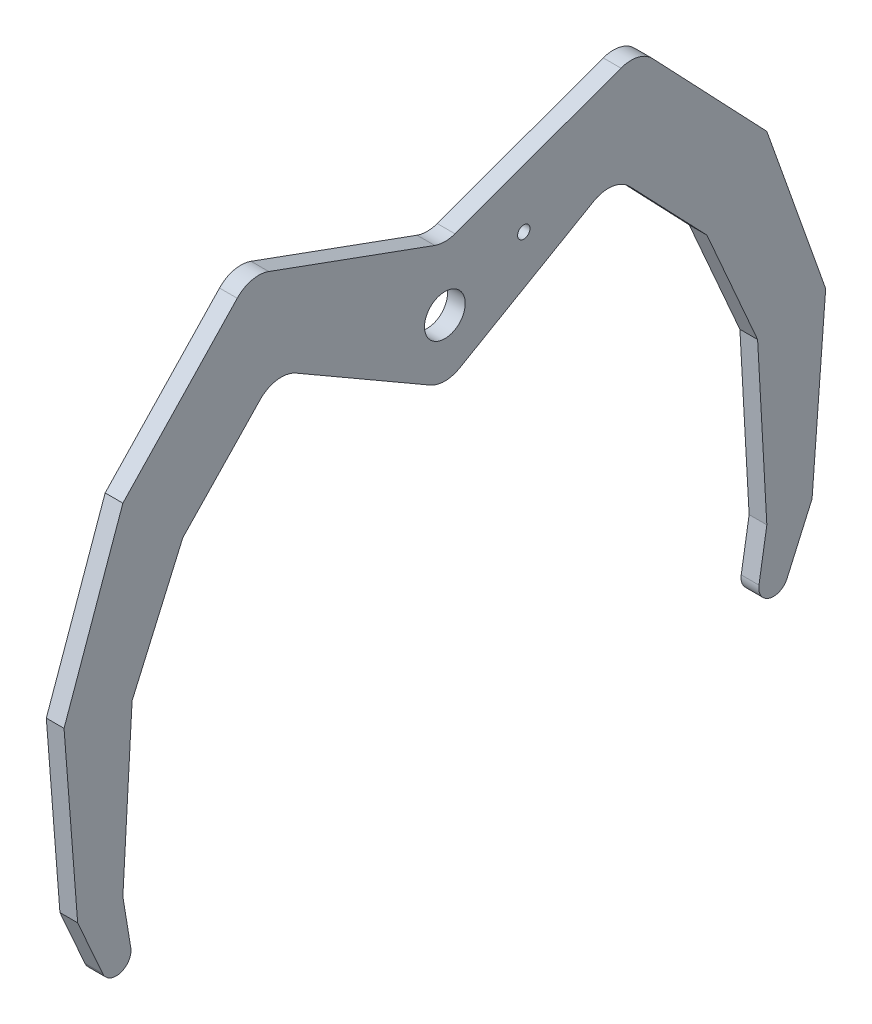
ISO-10303-21;
HEADER;
FILE_DESCRIPTION(('STEP AP214'),'2;1');
FILE_NAME('part.step','',(''),(''),'','','');
FILE_SCHEMA(('AUTOMOTIVE_DESIGN { 1 0 10303 214 1 1 1 1 }'));
ENDSEC;
DATA;
#1=APPLICATION_CONTEXT('core data for automotive mechanical design processes');
#2=APPLICATION_PROTOCOL_DEFINITION('international standard','automotive_design',2000,#1);
#3=PRODUCT_CONTEXT('',#1,'mechanical');
#4=PRODUCT('Part','Part','',(#3));
#5=PRODUCT_RELATED_PRODUCT_CATEGORY('part','',(#4));
#6=PRODUCT_DEFINITION_FORMATION('','',#4);
#7=PRODUCT_DEFINITION_CONTEXT('part definition',#1,'design');
#8=PRODUCT_DEFINITION('design','',#6,#7);
#9=PRODUCT_DEFINITION_SHAPE('','',#8);
#10=(LENGTH_UNIT() NAMED_UNIT(*) SI_UNIT(.MILLI.,.METRE.));
#11=(NAMED_UNIT(*) PLANE_ANGLE_UNIT() SI_UNIT($,.RADIAN.));
#12=(NAMED_UNIT(*) SI_UNIT($,.STERADIAN.) SOLID_ANGLE_UNIT());
#13=UNCERTAINTY_MEASURE_WITH_UNIT(LENGTH_MEASURE(1.E-05),#10,'distance_accuracy_value','');
#14=(GEOMETRIC_REPRESENTATION_CONTEXT(3) GLOBAL_UNCERTAINTY_ASSIGNED_CONTEXT((#13)) GLOBAL_UNIT_ASSIGNED_CONTEXT((#10,
#11,#12)) REPRESENTATION_CONTEXT('',''));
#15=CARTESIAN_POINT('',(0.,0.,0.));
#16=DIRECTION('',(0.,0.,1.));
#17=DIRECTION('',(1.,0.,0.));
#18=AXIS2_PLACEMENT_3D('',#15,#16,#17);
#19=CARTESIAN_POINT('',(3.,-66.5622399920911,-55.6324415796389));
#20=DIRECTION('',(1.,0.,0.));
#21=DIRECTION('',(0.,0.,-1.));
#22=AXIS2_PLACEMENT_3D('',#19,#20,#21);
#23=PLANE('',#22);
#24=CARTESIAN_POINT('',(3.,0.,0.));
#25=DIRECTION('',(1.,0.,0.));
#26=DIRECTION('',(0.,0.,-1.));
#27=AXIS2_PLACEMENT_3D('',#24,#25,#26);
#28=CIRCLE('',#27,3.45);
#29=CARTESIAN_POINT('',(3.,0.,-3.45));
#30=VERTEX_POINT('',#29);
#31=EDGE_CURVE('E254',#30,#30,#28,.T.);
#32=ORIENTED_EDGE('',*,*,#31,.F.);
#33=EDGE_LOOP('',(#32));
#34=FACE_BOUND('',#33,.T.);
#35=CARTESIAN_POINT('',(3.,-66.5622399920911,-55.6324415796389));
#36=DIRECTION('',(1.,0.,0.));
#37=DIRECTION('',(0.,0.,-1.));
#38=AXIS2_PLACEMENT_3D('',#35,#36,#37);
#39=CIRCLE('',#38,2.49999999999999);
#40=CARTESIAN_POINT('',(3.,-66.1574640748136,-53.1654279078502));
#41=VERTEX_POINT('',#40);
#42=CARTESIAN_POINT('',(3.,-67.5747741913046,-57.9182181425214));
#43=VERTEX_POINT('',#42);
#44=EDGE_CURVE('E305',#41,#43,#39,.T.);
#45=ORIENTED_EDGE('',*,*,#44,.T.);
#46=DIRECTION('',(0.,0.914310625153023,-0.405013679685377));
#47=VECTOR('',#46,1.);
#48=CARTESIAN_POINT('',(3.,-58.0020942634529,-62.1586438964939));
#49=LINE('',#48,#47);
#50=CARTESIAN_POINT('',(3.,-58.0020942634529,-62.1586438964939));
#51=VERTEX_POINT('',#50);
#52=EDGE_CURVE('E153',#43,#51,#49,.T.);
#53=ORIENTED_EDGE('',*,*,#52,.T.);
#54=DIRECTION('',(0.,0.996996693995207,-0.077444122841099));
#55=VECTOR('',#54,1.);
#56=CARTESIAN_POINT('',(3.,-58.0020942634529,-62.1586438964939));
#57=LINE('',#56,#55);
#58=CARTESIAN_POINT('',(3.,-28.3422759025482,-64.4625418235593));
#59=VERTEX_POINT('',#58);
#60=EDGE_CURVE('E380',#51,#59,#57,.T.);
#61=ORIENTED_EDGE('',*,*,#60,.T.);
#62=DIRECTION('',(0.,0.94230116363435,0.33476636183068));
#63=VECTOR('',#62,1.);
#64=CARTESIAN_POINT('',(3.,-28.3422759025482,-64.4625418235593));
#65=LINE('',#64,#63);
#66=CARTESIAN_POINT('',(3.,-0.309603855595102,-54.5035223553496));
#67=VERTEX_POINT('',#66);
#68=EDGE_CURVE('E399',#59,#67,#65,.T.);
#69=ORIENTED_EDGE('',*,*,#68,.T.);
#70=DIRECTION('',(0.,0.724673201543788,0.689092701285013));
#71=VECTOR('',#70,1.);
#72=CARTESIAN_POINT('',(3.,-0.309603855595102,-54.5035223553496));
#73=LINE('',#72,#71);
#74=CARTESIAN_POINT('',(3.,20.0477585303964,-35.1456796647183));
#75=VERTEX_POINT('',#74);
#76=EDGE_CURVE('E396',#67,#75,#73,.T.);
#77=ORIENTED_EDGE('',*,*,#76,.T.);
#78=CARTESIAN_POINT('',(3.,16.6022950239714,-31.5223136569994));
#79=DIRECTION('',(1.,0.,0.));
#80=DIRECTION('',(0.,0.,1.));
#81=AXIS2_PLACEMENT_3D('',#78,#79,#80);
#82=CIRCLE('',#81,5.);
#83=CARTESIAN_POINT('',(3.,21.3007581279009,-29.812212940371));
#84=VERTEX_POINT('',#83);
#85=EDGE_CURVE('E398',#75,#84,#82,.T.);
#86=ORIENTED_EDGE('',*,*,#85,.T.);
#87=DIRECTION('',(0.,-0.342020143325673,0.939692620785907));
#88=VECTOR('',#87,1.);
#89=CARTESIAN_POINT('',(3.,11.07242575845,-1.71010071662838));
#90=LINE('',#89,#88);
#91=CARTESIAN_POINT('',(3.,11.07242575845,-1.71010071662839));
#92=VERTEX_POINT('',#91);
#93=EDGE_CURVE('E401',#84,#92,#90,.T.);
#94=ORIENTED_EDGE('',*,*,#93,.T.);
#95=CARTESIAN_POINT('',(3.,15.7708888623796,0.));
#96=DIRECTION('',(-1.,0.,0.));
#97=DIRECTION('',(0.,0.,1.));
#98=AXIS2_PLACEMENT_3D('',#95,#96,#97);
#99=CIRCLE('',#98,5.);
#100=CARTESIAN_POINT('',(3.,11.07242575845,1.71010071662838));
#101=VERTEX_POINT('',#100);
#102=EDGE_CURVE('E407',#92,#101,#99,.T.);
#103=ORIENTED_EDGE('',*,*,#102,.T.);
#104=DIRECTION('',(0.,0.342020143325673,0.939692620785907));
#105=VECTOR('',#104,1.);
#106=CARTESIAN_POINT('',(3.,11.07242575845,1.71010071662838));
#107=LINE('',#106,#105);
#108=CARTESIAN_POINT('',(3.,21.3007581279009,29.812212940371));
#109=VERTEX_POINT('',#108);
#110=EDGE_CURVE('E409',#101,#109,#107,.T.);
#111=ORIENTED_EDGE('',*,*,#110,.T.);
#112=CARTESIAN_POINT('',(3.,16.6022950239714,31.5223136569994));
#113=DIRECTION('',(1.,0.,0.));
#114=DIRECTION('',(0.,0.,-1.));
#115=AXIS2_PLACEMENT_3D('',#112,#113,#114);
#116=CIRCLE('',#115,5.);
#117=CARTESIAN_POINT('',(3.,20.0477585303964,35.1456796647183));
#118=VERTEX_POINT('',#117);
#119=EDGE_CURVE('E411',#109,#118,#116,.T.);
#120=ORIENTED_EDGE('',*,*,#119,.T.);
#121=DIRECTION('',(0.,-0.724673201543788,0.689092701285013));
#122=VECTOR('',#121,1.);
#123=CARTESIAN_POINT('',(3.,-0.309603855595116,54.5035223553496));
#124=LINE('',#123,#122);
#125=CARTESIAN_POINT('',(3.,-0.309603855595116,54.5035223553496));
#126=VERTEX_POINT('',#125);
#127=EDGE_CURVE('E413',#118,#126,#124,.T.);
#128=ORIENTED_EDGE('',*,*,#127,.T.);
#129=DIRECTION('',(0.,-0.94230116363435,0.33476636183068));
#130=VECTOR('',#129,1.);
#131=CARTESIAN_POINT('',(3.,-28.3422759025482,64.4625418235593));
#132=LINE('',#131,#130);
#133=CARTESIAN_POINT('',(3.,-28.3422759025482,64.4625418235593));
#134=VERTEX_POINT('',#133);
#135=EDGE_CURVE('E415',#126,#134,#132,.T.);
#136=ORIENTED_EDGE('',*,*,#135,.T.);
#137=DIRECTION('',(0.,-0.996996693995207,-0.0774441228410994));
#138=VECTOR('',#137,1.);
#139=CARTESIAN_POINT('',(3.,-58.0020942634529,62.1586438964939));
#140=LINE('',#139,#138);
#141=CARTESIAN_POINT('',(3.,-58.0020942634529,62.1586438964939));
#142=VERTEX_POINT('',#141);
#143=EDGE_CURVE('E417',#134,#142,#140,.T.);
#144=ORIENTED_EDGE('',*,*,#143,.T.);
#145=DIRECTION('',(0.,-0.914310625153023,-0.405013679685375));
#146=VECTOR('',#145,1.);
#147=CARTESIAN_POINT('',(3.,-58.0020942634529,62.1586438964939));
#148=LINE('',#147,#146);
#149=CARTESIAN_POINT('',(3.,-67.5747741913046,57.9182181425214));
#150=VERTEX_POINT('',#149);
#151=EDGE_CURVE('E419',#142,#150,#148,.T.);
#152=ORIENTED_EDGE('',*,*,#151,.T.);
#153=CARTESIAN_POINT('',(3.,-66.5622399920911,55.6324415796389));
#154=DIRECTION('',(1.,0.,0.));
#155=DIRECTION('',(0.,0.,1.));
#156=AXIS2_PLACEMENT_3D('',#153,#154,#155);
#157=CIRCLE('',#156,2.50000000000001);
#158=CARTESIAN_POINT('',(3.,-66.1574640748136,53.1654279078502));
#159=VERTEX_POINT('',#158);
#160=EDGE_CURVE('E421',#150,#159,#157,.T.);
#161=ORIENTED_EDGE('',*,*,#160,.T.);
#162=DIRECTION('',(0.,0.986805468715459,0.161910366911026));
#163=VECTOR('',#162,1.);
#164=CARTESIAN_POINT('',(3.,-58.0020942634518,54.5035223553521));
#165=LINE('',#164,#163);
#166=CARTESIAN_POINT('',(3.,-58.0020942634518,54.5035223553521));
#167=VERTEX_POINT('',#166);
#168=EDGE_CURVE('E423',#159,#167,#165,.T.);
#169=ORIENTED_EDGE('',*,*,#168,.T.);
#170=DIRECTION('',(0.,0.998439677434941,-0.0558409394943517));
#171=VECTOR('',#170,1.);
#172=CARTESIAN_POINT('',(3.,-30.0455467703549,52.939962821096));
#173=LINE('',#172,#171);
#174=CARTESIAN_POINT('',(3.,-30.0455467703549,52.939962821096));
#175=VERTEX_POINT('',#174);
#176=EDGE_CURVE('E425',#167,#175,#173,.T.);
#177=ORIENTED_EDGE('',*,*,#176,.T.);
#178=DIRECTION('',(0.,0.916052504912047,-0.401058360147702));
#179=VECTOR('',#178,1.);
#180=CARTESIAN_POINT('',(3.,-10.4499999999942,44.3608062642641));
#181=LINE('',#180,#179);
#182=CARTESIAN_POINT('',(3.,-10.4499999999942,44.3608062642641));
#183=VERTEX_POINT('',#182);
#184=EDGE_CURVE('E427',#175,#183,#181,.T.);
#185=ORIENTED_EDGE('',*,*,#184,.T.);
#186=DIRECTION('',(0.,0.722655874852958,-0.691207990796191));
#187=VECTOR('',#186,1.);
#188=CARTESIAN_POINT('',(3.,-10.4499999999942,44.3608062642641));
#189=LINE('',#188,#187);
#190=CARTESIAN_POINT('',(3.,3.21304744696194,31.292334945346));
#191=VERTEX_POINT('',#190);
#192=EDGE_CURVE('E429',#183,#191,#189,.T.);
#193=ORIENTED_EDGE('',*,*,#192,.T.);
#194=CARTESIAN_POINT('',(3.,-0.242992507018251,27.6790555710804));
#195=DIRECTION('',(-1.,0.,0.));
#196=DIRECTION('',(0.,0.,1.));
#197=AXIS2_PLACEMENT_3D('',#194,#195,#196);
#198=CIRCLE('',#197,5.00000000000006);
#199=CARTESIAN_POINT('',(3.,4.08713451190401,25.1790555710804));
#200=VERTEX_POINT('',#199);
#201=EDGE_CURVE('E431',#191,#200,#198,.T.);
#202=ORIENTED_EDGE('',*,*,#201,.T.);
#203=DIRECTION('',(0.,-0.500000000000005,-0.866025403784436));
#204=VECTOR('',#203,1.);
#205=CARTESIAN_POINT('',(3.,-9.00662432702592,2.50000000000004));
#206=LINE('',#205,#204);
#207=CARTESIAN_POINT('',(3.,-9.00662432702591,2.50000000000004));
#208=VERTEX_POINT('',#207);
#209=EDGE_CURVE('E433',#200,#208,#206,.T.);
#210=ORIENTED_EDGE('',*,*,#209,.T.);
#211=CARTESIAN_POINT('',(3.,-4.67649730810375,0.));
#212=DIRECTION('',(1.,0.,0.));
#213=DIRECTION('',(0.,0.,-1.));
#214=AXIS2_PLACEMENT_3D('',#211,#212,#213);
#215=CIRCLE('',#214,5.);
#216=CARTESIAN_POINT('',(3.,-9.00662432702592,-2.50000000000005));
#217=VERTEX_POINT('',#216);
#218=EDGE_CURVE('E435',#208,#217,#215,.T.);
#219=ORIENTED_EDGE('',*,*,#218,.T.);
#220=DIRECTION('',(0.,0.500000000000004,-0.866025403784436));
#221=VECTOR('',#220,1.);
#222=CARTESIAN_POINT('',(3.,-9.00662432702592,-2.50000000000005));
#223=LINE('',#222,#221);
#224=CARTESIAN_POINT('',(3.,4.08713451190474,-25.1790555710809));
#225=VERTEX_POINT('',#224);
#226=EDGE_CURVE('E437',#217,#225,#223,.T.);
#227=ORIENTED_EDGE('',*,*,#226,.T.);
#228=CARTESIAN_POINT('',(3.,-0.242992507018233,-27.6790555710804));
#229=DIRECTION('',(-1.,0.,0.));
#230=DIRECTION('',(0.,0.,-1.));
#231=AXIS2_PLACEMENT_3D('',#228,#229,#230);
#232=CIRCLE('',#231,5.00000000000041);
#233=CARTESIAN_POINT('',(3.,3.21304744696305,-31.292334945346));
#234=VERTEX_POINT('',#233);
#235=EDGE_CURVE('E439',#225,#234,#232,.T.);
#236=ORIENTED_EDGE('',*,*,#235,.T.);
#237=DIRECTION('',(0.,-0.722655874852977,-0.691207990796171));
#238=VECTOR('',#237,1.);
#239=CARTESIAN_POINT('',(3.,-10.449999999994,-44.3608062642643));
#240=LINE('',#239,#238);
#241=CARTESIAN_POINT('',(3.,-10.449999999994,-44.3608062642643));
#242=VERTEX_POINT('',#241);
#243=EDGE_CURVE('E232',#234,#242,#240,.T.);
#244=ORIENTED_EDGE('',*,*,#243,.T.);
#245=DIRECTION('',(0.,-0.916052504912035,-0.40105836014773));
#246=VECTOR('',#245,1.);
#247=CARTESIAN_POINT('',(3.,-10.449999999994,-44.3608062642643));
#248=LINE('',#247,#246);
#249=CARTESIAN_POINT('',(3.,-30.0455467703544,-52.9399628210968));
#250=VERTEX_POINT('',#249);
#251=EDGE_CURVE('E226',#242,#250,#248,.T.);
#252=ORIENTED_EDGE('',*,*,#251,.T.);
#253=DIRECTION('',(0.,-0.998439677434942,-0.0558409394943253));
#254=VECTOR('',#253,1.);
#255=CARTESIAN_POINT('',(3.,-30.0455467703544,-52.9399628210968));
#256=LINE('',#255,#254);
#257=CARTESIAN_POINT('',(3.,-58.0020942634518,-54.5035223553522));
#258=VERTEX_POINT('',#257);
#259=EDGE_CURVE('E230',#250,#258,#256,.T.);
#260=ORIENTED_EDGE('',*,*,#259,.T.);
#261=DIRECTION('',(0.,-0.986805468715459,0.161910366911027));
#262=VECTOR('',#261,1.);
#263=CARTESIAN_POINT('',(3.,-58.0020942634518,-54.5035223553522));
#264=LINE('',#263,#262);
#265=EDGE_CURVE('E50',#258,#41,#264,.T.);
#266=ORIENTED_EDGE('',*,*,#265,.T.);
#267=EDGE_LOOP('',(#45,#53,#61,#69,#77,#86,#94,#103,#111,#120,#128,#136,#144,#152,#161,#169,
#177,#185,#193,#202,#210,#219,#227,#236,#244,#252,#260,#266));
#268=FACE_BOUND('',#267,.T.);
#269=CARTESIAN_POINT('',(3.,5.51119594978968,-13.3577400484896));
#270=DIRECTION('',(1.,0.,0.));
#271=DIRECTION('',(0.,0.,-1.));
#272=AXIS2_PLACEMENT_3D('',#269,#270,#271);
#273=CIRCLE('',#272,1.05);
#274=CARTESIAN_POINT('',(3.,5.51119594978968,-14.4077400484896));
#275=VERTEX_POINT('',#274);
#276=EDGE_CURVE('E481',#275,#275,#273,.T.);
#277=ORIENTED_EDGE('',*,*,#276,.F.);
#278=EDGE_LOOP('',(#277));
#279=FACE_BOUND('',#278,.T.);
#280=ADVANCED_FACE('F33',(#34,#268,#279),#23,.T.);
#281=CARTESIAN_POINT('',(0.,-66.5622399920911,-55.6324415796389));
#282=DIRECTION('',(1.,0.,0.));
#283=DIRECTION('',(0.,0.,-1.));
#284=AXIS2_PLACEMENT_3D('',#281,#282,#283);
#285=PLANE('',#284);
#286=CARTESIAN_POINT('',(0.,-66.5622399920911,-55.6324415796389));
#287=DIRECTION('',(1.,0.,0.));
#288=DIRECTION('',(0.,0.,-1.));
#289=AXIS2_PLACEMENT_3D('',#286,#287,#288);
#290=CIRCLE('',#289,2.49999999999999);
#291=CARTESIAN_POINT('',(0.,-66.1574640748136,-53.1654279078502));
#292=VERTEX_POINT('',#291);
#293=CARTESIAN_POINT('',(0.,-67.5747741913046,-57.9182181425214));
#294=VERTEX_POINT('',#293);
#295=EDGE_CURVE('E250',#292,#294,#290,.T.);
#296=ORIENTED_EDGE('',*,*,#295,.F.);
#297=DIRECTION('',(0.,-0.986805468715459,0.161910366911027));
#298=VECTOR('',#297,1.);
#299=CARTESIAN_POINT('',(0.,-58.0020942634518,-54.5035223553522));
#300=LINE('',#299,#298);
#301=CARTESIAN_POINT('',(0.,-58.0020942634518,-54.5035223553522));
#302=VERTEX_POINT('',#301);
#303=EDGE_CURVE('E145',#302,#292,#300,.T.);
#304=ORIENTED_EDGE('',*,*,#303,.F.);
#305=DIRECTION('',(0.,-0.998439677434942,-0.0558409394943253));
#306=VECTOR('',#305,1.);
#307=CARTESIAN_POINT('',(0.,-30.0455467703544,-52.9399628210968));
#308=LINE('',#307,#306);
#309=CARTESIAN_POINT('',(0.,-30.0455467703544,-52.9399628210968));
#310=VERTEX_POINT('',#309);
#311=EDGE_CURVE('E139',#310,#302,#308,.T.);
#312=ORIENTED_EDGE('',*,*,#311,.F.);
#313=DIRECTION('',(0.,-0.916052504912035,-0.40105836014773));
#314=VECTOR('',#313,1.);
#315=CARTESIAN_POINT('',(0.,-10.449999999994,-44.3608062642643));
#316=LINE('',#315,#314);
#317=CARTESIAN_POINT('',(0.,-10.449999999994,-44.3608062642643));
#318=VERTEX_POINT('',#317);
#319=EDGE_CURVE('E240',#318,#310,#316,.T.);
#320=ORIENTED_EDGE('',*,*,#319,.F.);
#321=DIRECTION('',(0.,-0.722655874852977,-0.691207990796171));
#322=VECTOR('',#321,1.);
#323=CARTESIAN_POINT('',(0.,-10.449999999994,-44.3608062642643));
#324=LINE('',#323,#322);
#325=CARTESIAN_POINT('',(0.,3.21304744696305,-31.292334945346));
#326=VERTEX_POINT('',#325);
#327=EDGE_CURVE('E300',#326,#318,#324,.T.);
#328=ORIENTED_EDGE('',*,*,#327,.F.);
#329=CARTESIAN_POINT('',(0.,-0.242992507018233,-27.6790555710804));
#330=DIRECTION('',(-1.,0.,0.));
#331=DIRECTION('',(0.,0.,-1.));
#332=AXIS2_PLACEMENT_3D('',#329,#330,#331);
#333=CIRCLE('',#332,5.00000000000041);
#334=CARTESIAN_POINT('',(0.,4.08713451190474,-25.1790555710809));
#335=VERTEX_POINT('',#334);
#336=EDGE_CURVE('E298',#335,#326,#333,.T.);
#337=ORIENTED_EDGE('',*,*,#336,.F.);
#338=DIRECTION('',(0.,0.500000000000004,-0.866025403784436));
#339=VECTOR('',#338,1.);
#340=CARTESIAN_POINT('',(0.,-9.00662432702592,-2.50000000000005));
#341=LINE('',#340,#339);
#342=CARTESIAN_POINT('',(0.,-9.00662432702592,-2.50000000000005));
#343=VERTEX_POINT('',#342);
#344=EDGE_CURVE('E296',#343,#335,#341,.T.);
#345=ORIENTED_EDGE('',*,*,#344,.F.);
#346=CARTESIAN_POINT('',(0.,-4.67649730810375,0.));
#347=DIRECTION('',(1.,0.,0.));
#348=DIRECTION('',(0.,0.,-1.));
#349=AXIS2_PLACEMENT_3D('',#346,#347,#348);
#350=CIRCLE('',#349,5.);
#351=CARTESIAN_POINT('',(0.,-9.00662432702591,2.50000000000004));
#352=VERTEX_POINT('',#351);
#353=EDGE_CURVE('E294',#352,#343,#350,.T.);
#354=ORIENTED_EDGE('',*,*,#353,.F.);
#355=DIRECTION('',(0.,-0.500000000000005,-0.866025403784436));
#356=VECTOR('',#355,1.);
#357=CARTESIAN_POINT('',(0.,-9.00662432702592,2.50000000000004));
#358=LINE('',#357,#356);
#359=CARTESIAN_POINT('',(0.,4.08713451190401,25.1790555710804));
#360=VERTEX_POINT('',#359);
#361=EDGE_CURVE('E292',#360,#352,#358,.T.);
#362=ORIENTED_EDGE('',*,*,#361,.F.);
#363=CARTESIAN_POINT('',(0.,-0.242992507018251,27.6790555710804));
#364=DIRECTION('',(-1.,0.,0.));
#365=DIRECTION('',(0.,0.,1.));
#366=AXIS2_PLACEMENT_3D('',#363,#364,#365);
#367=CIRCLE('',#366,5.00000000000006);
#368=CARTESIAN_POINT('',(0.,3.21304744696194,31.292334945346));
#369=VERTEX_POINT('',#368);
#370=EDGE_CURVE('E290',#369,#360,#367,.T.);
#371=ORIENTED_EDGE('',*,*,#370,.F.);
#372=DIRECTION('',(0.,0.722655874852958,-0.691207990796191));
#373=VECTOR('',#372,1.);
#374=CARTESIAN_POINT('',(0.,-10.4499999999942,44.3608062642641));
#375=LINE('',#374,#373);
#376=CARTESIAN_POINT('',(0.,-10.4499999999942,44.3608062642641));
#377=VERTEX_POINT('',#376);
#378=EDGE_CURVE('E288',#377,#369,#375,.T.);
#379=ORIENTED_EDGE('',*,*,#378,.F.);
#380=DIRECTION('',(0.,0.916052504912047,-0.401058360147702));
#381=VECTOR('',#380,1.);
#382=CARTESIAN_POINT('',(0.,-10.4499999999942,44.3608062642641));
#383=LINE('',#382,#381);
#384=CARTESIAN_POINT('',(0.,-30.0455467703549,52.939962821096));
#385=VERTEX_POINT('',#384);
#386=EDGE_CURVE('E286',#385,#377,#383,.T.);
#387=ORIENTED_EDGE('',*,*,#386,.F.);
#388=DIRECTION('',(0.,0.998439677434941,-0.0558409394943517));
#389=VECTOR('',#388,1.);
#390=CARTESIAN_POINT('',(0.,-30.0455467703549,52.939962821096));
#391=LINE('',#390,#389);
#392=CARTESIAN_POINT('',(0.,-58.0020942634518,54.5035223553521));
#393=VERTEX_POINT('',#392);
#394=EDGE_CURVE('E284',#393,#385,#391,.T.);
#395=ORIENTED_EDGE('',*,*,#394,.F.);
#396=DIRECTION('',(0.,0.986805468715459,0.161910366911026));
#397=VECTOR('',#396,1.);
#398=CARTESIAN_POINT('',(0.,-58.0020942634518,54.5035223553521));
#399=LINE('',#398,#397);
#400=CARTESIAN_POINT('',(0.,-66.1574640748136,53.1654279078502));
#401=VERTEX_POINT('',#400);
#402=EDGE_CURVE('E282',#401,#393,#399,.T.);
#403=ORIENTED_EDGE('',*,*,#402,.F.);
#404=CARTESIAN_POINT('',(0.,-66.5622399920911,55.6324415796389));
#405=DIRECTION('',(1.,0.,0.));
#406=DIRECTION('',(0.,0.,1.));
#407=AXIS2_PLACEMENT_3D('',#404,#405,#406);
#408=CIRCLE('',#407,2.50000000000001);
#409=CARTESIAN_POINT('',(0.,-67.5747741913046,57.9182181425214));
#410=VERTEX_POINT('',#409);
#411=EDGE_CURVE('E280',#410,#401,#408,.T.);
#412=ORIENTED_EDGE('',*,*,#411,.F.);
#413=DIRECTION('',(0.,-0.914310625153023,-0.405013679685375));
#414=VECTOR('',#413,1.);
#415=CARTESIAN_POINT('',(0.,-58.0020942634529,62.1586438964939));
#416=LINE('',#415,#414);
#417=CARTESIAN_POINT('',(0.,-58.0020942634529,62.1586438964939));
#418=VERTEX_POINT('',#417);
#419=EDGE_CURVE('E278',#418,#410,#416,.T.);
#420=ORIENTED_EDGE('',*,*,#419,.F.);
#421=DIRECTION('',(0.,-0.996996693995207,-0.0774441228410994));
#422=VECTOR('',#421,1.);
#423=CARTESIAN_POINT('',(0.,-58.0020942634529,62.1586438964939));
#424=LINE('',#423,#422);
#425=CARTESIAN_POINT('',(0.,-28.3422759025482,64.4625418235593));
#426=VERTEX_POINT('',#425);
#427=EDGE_CURVE('E276',#426,#418,#424,.T.);
#428=ORIENTED_EDGE('',*,*,#427,.F.);
#429=DIRECTION('',(0.,-0.94230116363435,0.33476636183068));
#430=VECTOR('',#429,1.);
#431=CARTESIAN_POINT('',(0.,-28.3422759025482,64.4625418235593));
#432=LINE('',#431,#430);
#433=CARTESIAN_POINT('',(0.,-0.309603855595116,54.5035223553496));
#434=VERTEX_POINT('',#433);
#435=EDGE_CURVE('E274',#434,#426,#432,.T.);
#436=ORIENTED_EDGE('',*,*,#435,.F.);
#437=DIRECTION('',(0.,-0.724673201543788,0.689092701285013));
#438=VECTOR('',#437,1.);
#439=CARTESIAN_POINT('',(0.,-0.309603855595116,54.5035223553496));
#440=LINE('',#439,#438);
#441=CARTESIAN_POINT('',(0.,20.0477585303964,35.1456796647183));
#442=VERTEX_POINT('',#441);
#443=EDGE_CURVE('E272',#442,#434,#440,.T.);
#444=ORIENTED_EDGE('',*,*,#443,.F.);
#445=CARTESIAN_POINT('',(0.,16.6022950239714,31.5223136569994));
#446=DIRECTION('',(1.,0.,0.));
#447=DIRECTION('',(0.,0.,-1.));
#448=AXIS2_PLACEMENT_3D('',#445,#446,#447);
#449=CIRCLE('',#448,5.);
#450=CARTESIAN_POINT('',(0.,21.3007581279009,29.812212940371));
#451=VERTEX_POINT('',#450);
#452=EDGE_CURVE('E270',#451,#442,#449,.T.);
#453=ORIENTED_EDGE('',*,*,#452,.F.);
#454=DIRECTION('',(0.,0.342020143325673,0.939692620785907));
#455=VECTOR('',#454,1.);
#456=CARTESIAN_POINT('',(0.,11.07242575845,1.71010071662838));
#457=LINE('',#456,#455);
#458=CARTESIAN_POINT('',(0.,11.07242575845,1.71010071662838));
#459=VERTEX_POINT('',#458);
#460=EDGE_CURVE('E268',#459,#451,#457,.T.);
#461=ORIENTED_EDGE('',*,*,#460,.F.);
#462=CARTESIAN_POINT('',(0.,15.7708888623796,0.));
#463=DIRECTION('',(-1.,0.,0.));
#464=DIRECTION('',(0.,0.,1.));
#465=AXIS2_PLACEMENT_3D('',#462,#463,#464);
#466=CIRCLE('',#465,5.);
#467=CARTESIAN_POINT('',(0.,11.07242575845,-1.71010071662839));
#468=VERTEX_POINT('',#467);
#469=EDGE_CURVE('E266',#468,#459,#466,.T.);
#470=ORIENTED_EDGE('',*,*,#469,.F.);
#471=DIRECTION('',(0.,-0.342020143325673,0.939692620785907));
#472=VECTOR('',#471,1.);
#473=CARTESIAN_POINT('',(0.,11.07242575845,-1.71010071662838));
#474=LINE('',#473,#472);
#475=CARTESIAN_POINT('',(0.,21.3007581279009,-29.812212940371));
#476=VERTEX_POINT('',#475);
#477=EDGE_CURVE('E264',#476,#468,#474,.T.);
#478=ORIENTED_EDGE('',*,*,#477,.F.);
#479=CARTESIAN_POINT('',(0.,16.6022950239714,-31.5223136569994));
#480=DIRECTION('',(1.,0.,0.));
#481=DIRECTION('',(0.,0.,1.));
#482=AXIS2_PLACEMENT_3D('',#479,#480,#481);
#483=CIRCLE('',#482,5.);
#484=CARTESIAN_POINT('',(0.,20.0477585303964,-35.1456796647183));
#485=VERTEX_POINT('',#484);
#486=EDGE_CURVE('E262',#485,#476,#483,.T.);
#487=ORIENTED_EDGE('',*,*,#486,.F.);
#488=DIRECTION('',(0.,0.724673201543788,0.689092701285013));
#489=VECTOR('',#488,1.);
#490=CARTESIAN_POINT('',(0.,-0.309603855595102,-54.5035223553496));
#491=LINE('',#490,#489);
#492=CARTESIAN_POINT('',(0.,-0.309603855595102,-54.5035223553496));
#493=VERTEX_POINT('',#492);
#494=EDGE_CURVE('E260',#493,#485,#491,.T.);
#495=ORIENTED_EDGE('',*,*,#494,.F.);
#496=DIRECTION('',(0.,0.94230116363435,0.33476636183068));
#497=VECTOR('',#496,1.);
#498=CARTESIAN_POINT('',(0.,-28.3422759025482,-64.4625418235593));
#499=LINE('',#498,#497);
#500=CARTESIAN_POINT('',(0.,-28.3422759025482,-64.4625418235593));
#501=VERTEX_POINT('',#500);
#502=EDGE_CURVE('E258',#501,#493,#499,.T.);
#503=ORIENTED_EDGE('',*,*,#502,.F.);
#504=DIRECTION('',(0.,0.996996693995207,-0.077444122841099));
#505=VECTOR('',#504,1.);
#506=CARTESIAN_POINT('',(0.,-58.0020942634529,-62.1586438964939));
#507=LINE('',#506,#505);
#508=CARTESIAN_POINT('',(0.,-58.0020942634529,-62.1586438964939));
#509=VERTEX_POINT('',#508);
#510=EDGE_CURVE('E256',#509,#501,#507,.T.);
#511=ORIENTED_EDGE('',*,*,#510,.F.);
#512=DIRECTION('',(0.,0.914310625153023,-0.405013679685377));
#513=VECTOR('',#512,1.);
#514=CARTESIAN_POINT('',(0.,-58.0020942634529,-62.1586438964939));
#515=LINE('',#514,#513);
#516=EDGE_CURVE('E253',#294,#509,#515,.T.);
#517=ORIENTED_EDGE('',*,*,#516,.F.);
#518=EDGE_LOOP('',(#296,#304,#312,#320,#328,#337,#345,#354,#362,#371,#379,#387,#395,#403,#412,
#420,#428,#436,#444,#453,#461,#470,#478,#487,#495,#503,#511,#517));
#519=FACE_BOUND('',#518,.T.);
#520=CARTESIAN_POINT('',(0.,0.,0.));
#521=DIRECTION('',(1.,0.,0.));
#522=DIRECTION('',(0.,0.,-1.));
#523=AXIS2_PLACEMENT_3D('',#520,#521,#522);
#524=CIRCLE('',#523,3.45);
#525=CARTESIAN_POINT('',(0.,0.,-3.45));
#526=VERTEX_POINT('',#525);
#527=EDGE_CURVE('E487',#526,#526,#524,.T.);
#528=ORIENTED_EDGE('',*,*,#527,.T.);
#529=EDGE_LOOP('',(#528));
#530=FACE_BOUND('',#529,.T.);
#531=CARTESIAN_POINT('',(0.,5.51119594978968,-13.3577400484896));
#532=DIRECTION('',(1.,0.,0.));
#533=DIRECTION('',(0.,0.,-1.));
#534=AXIS2_PLACEMENT_3D('',#531,#532,#533);
#535=CIRCLE('',#534,1.05);
#536=CARTESIAN_POINT('',(0.,5.51119594978968,-14.4077400484896));
#537=VERTEX_POINT('',#536);
#538=EDGE_CURVE('E484',#537,#537,#535,.T.);
#539=ORIENTED_EDGE('',*,*,#538,.T.);
#540=EDGE_LOOP('',(#539));
#541=FACE_BOUND('',#540,.T.);
#542=ADVANCED_FACE('F384',(#519,#530,#541),#285,.F.);
#543=CARTESIAN_POINT('',(3.,-66.5622399920911,-55.6324415796389));
#544=DIRECTION('',(-1.,0.,0.));
#545=DIRECTION('',(0.,0.,1.));
#546=AXIS2_PLACEMENT_3D('',#543,#544,#545);
#547=CYLINDRICAL_SURFACE('',#546,2.49999999999999);
#548=ORIENTED_EDGE('',*,*,#295,.T.);
#549=DIRECTION('',(-1.,0.,0.));
#550=VECTOR('',#549,1.);
#551=CARTESIAN_POINT('',(3.,-67.5747741913046,-57.9182181425214));
#552=LINE('',#551,#550);
#553=EDGE_CURVE('E11',#43,#294,#552,.T.);
#554=ORIENTED_EDGE('',*,*,#553,.F.);
#555=ORIENTED_EDGE('',*,*,#44,.F.);
#556=DIRECTION('',(-1.,0.,0.));
#557=VECTOR('',#556,1.);
#558=CARTESIAN_POINT('',(3.,-66.1574640748136,-53.1654279078502));
#559=LINE('',#558,#557);
#560=EDGE_CURVE('E246',#41,#292,#559,.T.);
#561=ORIENTED_EDGE('',*,*,#560,.T.);
#562=EDGE_LOOP('',(#548,#554,#555,#561));
#563=FACE_BOUND('',#562,.T.);
#564=ADVANCED_FACE('F35',(#563),#547,.T.);
#565=CARTESIAN_POINT('',(3.,-58.0020942634529,-62.1586438964939));
#566=DIRECTION('',(0.,0.405013679685377,0.914310625153022));
#567=DIRECTION('',(0.,-0.914310625153023,0.405013679685377));
#568=AXIS2_PLACEMENT_3D('',#565,#566,#567);
#569=PLANE('',#568);
#570=ORIENTED_EDGE('',*,*,#516,.T.);
#571=DIRECTION('',(-1.,0.,0.));
#572=VECTOR('',#571,1.);
#573=CARTESIAN_POINT('',(3.,-58.0020942634529,-62.1586438964939));
#574=LINE('',#573,#572);
#575=EDGE_CURVE('E42',#51,#509,#574,.T.);
#576=ORIENTED_EDGE('',*,*,#575,.F.);
#577=ORIENTED_EDGE('',*,*,#52,.F.);
#578=ORIENTED_EDGE('',*,*,#553,.T.);
#579=EDGE_LOOP('',(#570,#576,#577,#578));
#580=FACE_BOUND('',#579,.T.);
#581=ADVANCED_FACE('F740',(#580),#569,.F.);
#582=CARTESIAN_POINT('',(3.,-58.0020942634529,-62.1586438964939));
#583=DIRECTION('',(0.,0.077444122841099,0.996996693995207));
#584=DIRECTION('',(0.,-0.996996693995207,0.077444122841099));
#585=AXIS2_PLACEMENT_3D('',#582,#583,#584);
#586=PLANE('',#585);
#587=ORIENTED_EDGE('',*,*,#510,.T.);
#588=DIRECTION('',(-1.,0.,0.));
#589=VECTOR('',#588,1.);
#590=CARTESIAN_POINT('',(3.,-28.3422759025482,-64.4625418235593));
#591=LINE('',#590,#589);
#592=EDGE_CURVE('E372',#59,#501,#591,.T.);
#593=ORIENTED_EDGE('',*,*,#592,.F.);
#594=ORIENTED_EDGE('',*,*,#60,.F.);
#595=ORIENTED_EDGE('',*,*,#575,.T.);
#596=EDGE_LOOP('',(#587,#593,#594,#595));
#597=FACE_BOUND('',#596,.T.);
#598=ADVANCED_FACE('F378',(#597),#586,.F.);
#599=CARTESIAN_POINT('',(3.,-28.3422759025482,-64.4625418235593));
#600=DIRECTION('',(0.,-0.33476636183068,0.94230116363435));
#601=DIRECTION('',(0.,-0.94230116363435,-0.33476636183068));
#602=AXIS2_PLACEMENT_3D('',#599,#600,#601);
#603=PLANE('',#602);
#604=ORIENTED_EDGE('',*,*,#502,.T.);
#605=DIRECTION('',(-1.,0.,0.));
#606=VECTOR('',#605,1.);
#607=CARTESIAN_POINT('',(3.,-0.309603855595102,-54.5035223553496));
#608=LINE('',#607,#606);
#609=EDGE_CURVE('E369',#67,#493,#608,.T.);
#610=ORIENTED_EDGE('',*,*,#609,.F.);
#611=ORIENTED_EDGE('',*,*,#68,.F.);
#612=ORIENTED_EDGE('',*,*,#592,.T.);
#613=EDGE_LOOP('',(#604,#610,#611,#612));
#614=FACE_BOUND('',#613,.T.);
#615=ADVANCED_FACE('F390',(#614),#603,.F.);
#616=CARTESIAN_POINT('',(3.,-0.309603855595102,-54.5035223553496));
#617=DIRECTION('',(0.,-0.689092701285013,0.724673201543788));
#618=DIRECTION('',(0.,-0.724673201543788,-0.689092701285013));
#619=AXIS2_PLACEMENT_3D('',#616,#617,#618);
#620=PLANE('',#619);
#621=ORIENTED_EDGE('',*,*,#494,.T.);
#622=DIRECTION('',(-1.,0.,0.));
#623=VECTOR('',#622,1.);
#624=CARTESIAN_POINT('',(3.,20.0477585303964,-35.1456796647183));
#625=LINE('',#624,#623);
#626=EDGE_CURVE('E366',#75,#485,#625,.T.);
#627=ORIENTED_EDGE('',*,*,#626,.F.);
#628=ORIENTED_EDGE('',*,*,#76,.F.);
#629=ORIENTED_EDGE('',*,*,#609,.T.);
#630=EDGE_LOOP('',(#621,#627,#628,#629));
#631=FACE_BOUND('',#630,.T.);
#632=ADVANCED_FACE('F394',(#631),#620,.F.);
#633=CARTESIAN_POINT('',(3.,16.6022950239714,-31.5223136569994));
#634=DIRECTION('',(-1.,0.,0.));
#635=DIRECTION('',(0.,0.,1.));
#636=AXIS2_PLACEMENT_3D('',#633,#634,#635);
#637=CYLINDRICAL_SURFACE('',#636,5.);
#638=ORIENTED_EDGE('',*,*,#486,.T.);
#639=DIRECTION('',(-1.,0.,0.));
#640=VECTOR('',#639,1.);
#641=CARTESIAN_POINT('',(3.,21.3007581279009,-29.812212940371));
#642=LINE('',#641,#640);
#643=EDGE_CURVE('E363',#84,#476,#642,.T.);
#644=ORIENTED_EDGE('',*,*,#643,.F.);
#645=ORIENTED_EDGE('',*,*,#85,.F.);
#646=ORIENTED_EDGE('',*,*,#626,.T.);
#647=EDGE_LOOP('',(#638,#644,#645,#646));
#648=FACE_BOUND('',#647,.T.);
#649=ADVANCED_FACE('F705',(#648),#637,.T.);
#650=CARTESIAN_POINT('',(3.,11.07242575845,-1.71010071662838));
#651=DIRECTION('',(0.,-0.939692620785907,-0.342020143325673));
#652=DIRECTION('',(0.,0.342020143325673,-0.939692620785907));
#653=AXIS2_PLACEMENT_3D('',#650,#651,#652);
#654=PLANE('',#653);
#655=ORIENTED_EDGE('',*,*,#477,.T.);
#656=DIRECTION('',(-1.,0.,0.));
#657=VECTOR('',#656,1.);
#658=CARTESIAN_POINT('',(3.,11.07242575845,-1.71010071662839));
#659=LINE('',#658,#657);
#660=EDGE_CURVE('E360',#92,#468,#659,.T.);
#661=ORIENTED_EDGE('',*,*,#660,.F.);
#662=ORIENTED_EDGE('',*,*,#93,.F.);
#663=ORIENTED_EDGE('',*,*,#643,.T.);
#664=EDGE_LOOP('',(#655,#661,#662,#663));
#665=FACE_BOUND('',#664,.T.);
#666=ADVANCED_FACE('F695',(#665),#654,.F.);
#667=CARTESIAN_POINT('',(3.,15.7708888623796,0.));
#668=DIRECTION('',(-1.,0.,0.));
#669=DIRECTION('',(0.,0.,1.));
#670=AXIS2_PLACEMENT_3D('',#667,#668,#669);
#671=CYLINDRICAL_SURFACE('',#670,5.);
#672=ORIENTED_EDGE('',*,*,#469,.T.);
#673=DIRECTION('',(-1.,0.,0.));
#674=VECTOR('',#673,1.);
#675=CARTESIAN_POINT('',(3.,11.07242575845,1.71010071662838));
#676=LINE('',#675,#674);
#677=EDGE_CURVE('E357',#101,#459,#676,.T.);
#678=ORIENTED_EDGE('',*,*,#677,.F.);
#679=ORIENTED_EDGE('',*,*,#102,.F.);
#680=ORIENTED_EDGE('',*,*,#660,.T.);
#681=EDGE_LOOP('',(#672,#678,#679,#680));
#682=FACE_BOUND('',#681,.T.);
#683=ADVANCED_FACE('F685',(#682),#671,.F.);
#684=CARTESIAN_POINT('',(3.,11.07242575845,1.71010071662838));
#685=DIRECTION('',(0.,-0.939692620785907,0.342020143325673));
#686=DIRECTION('',(0.,-0.342020143325673,-0.939692620785907));
#687=AXIS2_PLACEMENT_3D('',#684,#685,#686);
#688=PLANE('',#687);
#689=ORIENTED_EDGE('',*,*,#460,.T.);
#690=DIRECTION('',(-1.,0.,0.));
#691=VECTOR('',#690,1.);
#692=CARTESIAN_POINT('',(3.,21.3007581279009,29.812212940371));
#693=LINE('',#692,#691);
#694=EDGE_CURVE('E354',#109,#451,#693,.T.);
#695=ORIENTED_EDGE('',*,*,#694,.F.);
#696=ORIENTED_EDGE('',*,*,#110,.F.);
#697=ORIENTED_EDGE('',*,*,#677,.T.);
#698=EDGE_LOOP('',(#689,#695,#696,#697));
#699=FACE_BOUND('',#698,.T.);
#700=ADVANCED_FACE('F675',(#699),#688,.F.);
#701=CARTESIAN_POINT('',(3.,16.6022950239714,31.5223136569994));
#702=DIRECTION('',(-1.,0.,0.));
#703=DIRECTION('',(0.,0.,1.));
#704=AXIS2_PLACEMENT_3D('',#701,#702,#703);
#705=CYLINDRICAL_SURFACE('',#704,5.);
#706=ORIENTED_EDGE('',*,*,#452,.T.);
#707=DIRECTION('',(-1.,0.,0.));
#708=VECTOR('',#707,1.);
#709=CARTESIAN_POINT('',(3.,20.0477585303964,35.1456796647183));
#710=LINE('',#709,#708);
#711=EDGE_CURVE('E351',#118,#442,#710,.T.);
#712=ORIENTED_EDGE('',*,*,#711,.F.);
#713=ORIENTED_EDGE('',*,*,#119,.F.);
#714=ORIENTED_EDGE('',*,*,#694,.T.);
#715=EDGE_LOOP('',(#706,#712,#713,#714));
#716=FACE_BOUND('',#715,.T.);
#717=ADVANCED_FACE('F665',(#716),#705,.T.);
#718=CARTESIAN_POINT('',(3.,-0.309603855595116,54.5035223553496));
#719=DIRECTION('',(0.,-0.689092701285013,-0.724673201543788));
#720=DIRECTION('',(0.,0.724673201543788,-0.689092701285013));
#721=AXIS2_PLACEMENT_3D('',#718,#719,#720);
#722=PLANE('',#721);
#723=ORIENTED_EDGE('',*,*,#443,.T.);
#724=DIRECTION('',(-1.,0.,0.));
#725=VECTOR('',#724,1.);
#726=CARTESIAN_POINT('',(3.,-0.309603855595116,54.5035223553496));
#727=LINE('',#726,#725);
#728=EDGE_CURVE('E348',#126,#434,#727,.T.);
#729=ORIENTED_EDGE('',*,*,#728,.F.);
#730=ORIENTED_EDGE('',*,*,#127,.F.);
#731=ORIENTED_EDGE('',*,*,#711,.T.);
#732=EDGE_LOOP('',(#723,#729,#730,#731));
#733=FACE_BOUND('',#732,.T.);
#734=ADVANCED_FACE('F655',(#733),#722,.F.);
#735=CARTESIAN_POINT('',(3.,-28.3422759025482,64.4625418235593));
#736=DIRECTION('',(0.,-0.33476636183068,-0.94230116363435));
#737=DIRECTION('',(0.,0.94230116363435,-0.33476636183068));
#738=AXIS2_PLACEMENT_3D('',#735,#736,#737);
#739=PLANE('',#738);
#740=ORIENTED_EDGE('',*,*,#435,.T.);
#741=DIRECTION('',(-1.,0.,0.));
#742=VECTOR('',#741,1.);
#743=CARTESIAN_POINT('',(3.,-28.3422759025482,64.4625418235593));
#744=LINE('',#743,#742);
#745=EDGE_CURVE('E345',#134,#426,#744,.T.);
#746=ORIENTED_EDGE('',*,*,#745,.F.);
#747=ORIENTED_EDGE('',*,*,#135,.F.);
#748=ORIENTED_EDGE('',*,*,#728,.T.);
#749=EDGE_LOOP('',(#740,#746,#747,#748));
#750=FACE_BOUND('',#749,.T.);
#751=ADVANCED_FACE('F645',(#750),#739,.F.);
#752=CARTESIAN_POINT('',(3.,-58.0020942634529,62.1586438964939));
#753=DIRECTION('',(0.,0.0774441228410994,-0.996996693995207));
#754=DIRECTION('',(0.,0.996996693995207,0.0774441228410994));
#755=AXIS2_PLACEMENT_3D('',#752,#753,#754);
#756=PLANE('',#755);
#757=ORIENTED_EDGE('',*,*,#427,.T.);
#758=DIRECTION('',(-1.,0.,0.));
#759=VECTOR('',#758,1.);
#760=CARTESIAN_POINT('',(3.,-58.0020942634529,62.1586438964939));
#761=LINE('',#760,#759);
#762=EDGE_CURVE('E342',#142,#418,#761,.T.);
#763=ORIENTED_EDGE('',*,*,#762,.F.);
#764=ORIENTED_EDGE('',*,*,#143,.F.);
#765=ORIENTED_EDGE('',*,*,#745,.T.);
#766=EDGE_LOOP('',(#757,#763,#764,#765));
#767=FACE_BOUND('',#766,.T.);
#768=ADVANCED_FACE('F635',(#767),#756,.F.);
#769=CARTESIAN_POINT('',(3.,-58.0020942634529,62.1586438964939));
#770=DIRECTION('',(0.,0.405013679685375,-0.914310625153023));
#771=DIRECTION('',(0.,0.914310625153023,0.405013679685376));
#772=AXIS2_PLACEMENT_3D('',#769,#770,#771);
#773=PLANE('',#772);
#774=ORIENTED_EDGE('',*,*,#419,.T.);
#775=DIRECTION('',(-1.,0.,0.));
#776=VECTOR('',#775,1.);
#777=CARTESIAN_POINT('',(3.,-67.5747741913046,57.9182181425214));
#778=LINE('',#777,#776);
#779=EDGE_CURVE('E339',#150,#410,#778,.T.);
#780=ORIENTED_EDGE('',*,*,#779,.F.);
#781=ORIENTED_EDGE('',*,*,#151,.F.);
#782=ORIENTED_EDGE('',*,*,#762,.T.);
#783=EDGE_LOOP('',(#774,#780,#781,#782));
#784=FACE_BOUND('',#783,.T.);
#785=ADVANCED_FACE('F625',(#784),#773,.F.);
#786=CARTESIAN_POINT('',(3.,-66.5622399920911,55.6324415796389));
#787=DIRECTION('',(-1.,0.,0.));
#788=DIRECTION('',(0.,0.,1.));
#789=AXIS2_PLACEMENT_3D('',#786,#787,#788);
#790=CYLINDRICAL_SURFACE('',#789,2.50000000000001);
#791=ORIENTED_EDGE('',*,*,#411,.T.);
#792=DIRECTION('',(-1.,0.,0.));
#793=VECTOR('',#792,1.);
#794=CARTESIAN_POINT('',(3.,-66.1574640748136,53.1654279078502));
#795=LINE('',#794,#793);
#796=EDGE_CURVE('E336',#159,#401,#795,.T.);
#797=ORIENTED_EDGE('',*,*,#796,.F.);
#798=ORIENTED_EDGE('',*,*,#160,.F.);
#799=ORIENTED_EDGE('',*,*,#779,.T.);
#800=EDGE_LOOP('',(#791,#797,#798,#799));
#801=FACE_BOUND('',#800,.T.);
#802=ADVANCED_FACE('F615',(#801),#790,.T.);
#803=CARTESIAN_POINT('',(3.,-58.0020942634518,54.5035223553521));
#804=DIRECTION('',(0.,-0.161910366911026,0.986805468715459));
#805=DIRECTION('',(0.,-0.986805468715459,-0.161910366911026));
#806=AXIS2_PLACEMENT_3D('',#803,#804,#805);
#807=PLANE('',#806);
#808=ORIENTED_EDGE('',*,*,#402,.T.);
#809=DIRECTION('',(-1.,0.,0.));
#810=VECTOR('',#809,1.);
#811=CARTESIAN_POINT('',(3.,-58.0020942634518,54.5035223553521));
#812=LINE('',#811,#810);
#813=EDGE_CURVE('E333',#167,#393,#812,.T.);
#814=ORIENTED_EDGE('',*,*,#813,.F.);
#815=ORIENTED_EDGE('',*,*,#168,.F.);
#816=ORIENTED_EDGE('',*,*,#796,.T.);
#817=EDGE_LOOP('',(#808,#814,#815,#816));
#818=FACE_BOUND('',#817,.T.);
#819=ADVANCED_FACE('F605',(#818),#807,.F.);
#820=CARTESIAN_POINT('',(3.,-30.0455467703549,52.939962821096));
#821=DIRECTION('',(0.,0.0558409394943517,0.998439677434941));
#822=DIRECTION('',(0.,-0.998439677434941,0.0558409394943517));
#823=AXIS2_PLACEMENT_3D('',#820,#821,#822);
#824=PLANE('',#823);
#825=ORIENTED_EDGE('',*,*,#394,.T.);
#826=DIRECTION('',(-1.,0.,0.));
#827=VECTOR('',#826,1.);
#828=CARTESIAN_POINT('',(3.,-30.0455467703549,52.939962821096));
#829=LINE('',#828,#827);
#830=EDGE_CURVE('E330',#175,#385,#829,.T.);
#831=ORIENTED_EDGE('',*,*,#830,.F.);
#832=ORIENTED_EDGE('',*,*,#176,.F.);
#833=ORIENTED_EDGE('',*,*,#813,.T.);
#834=EDGE_LOOP('',(#825,#831,#832,#833));
#835=FACE_BOUND('',#834,.T.);
#836=ADVANCED_FACE('F595',(#835),#824,.F.);
#837=CARTESIAN_POINT('',(3.,-10.4499999999942,44.3608062642641));
#838=DIRECTION('',(0.,0.401058360147701,0.916052504912047));
#839=DIRECTION('',(0.,-0.916052504912047,0.401058360147702));
#840=AXIS2_PLACEMENT_3D('',#837,#838,#839);
#841=PLANE('',#840);
#842=ORIENTED_EDGE('',*,*,#386,.T.);
#843=DIRECTION('',(-1.,0.,0.));
#844=VECTOR('',#843,1.);
#845=CARTESIAN_POINT('',(3.,-10.4499999999942,44.3608062642641));
#846=LINE('',#845,#844);
#847=EDGE_CURVE('E327',#183,#377,#846,.T.);
#848=ORIENTED_EDGE('',*,*,#847,.F.);
#849=ORIENTED_EDGE('',*,*,#184,.F.);
#850=ORIENTED_EDGE('',*,*,#830,.T.);
#851=EDGE_LOOP('',(#842,#848,#849,#850));
#852=FACE_BOUND('',#851,.T.);
#853=ADVANCED_FACE('F585',(#852),#841,.F.);
#854=CARTESIAN_POINT('',(3.,-10.4499999999942,44.3608062642641));
#855=DIRECTION('',(0.,0.69120799079619,0.722655874852957));
#856=DIRECTION('',(0.,-0.722655874852958,0.691207990796191));
#857=AXIS2_PLACEMENT_3D('',#854,#855,#856);
#858=PLANE('',#857);
#859=ORIENTED_EDGE('',*,*,#378,.T.);
#860=DIRECTION('',(-1.,0.,0.));
#861=VECTOR('',#860,1.);
#862=CARTESIAN_POINT('',(3.,3.21304744696194,31.292334945346));
#863=LINE('',#862,#861);
#864=EDGE_CURVE('E324',#191,#369,#863,.T.);
#865=ORIENTED_EDGE('',*,*,#864,.F.);
#866=ORIENTED_EDGE('',*,*,#192,.F.);
#867=ORIENTED_EDGE('',*,*,#847,.T.);
#868=EDGE_LOOP('',(#859,#865,#866,#867));
#869=FACE_BOUND('',#868,.T.);
#870=ADVANCED_FACE('F575',(#869),#858,.F.);
#871=CARTESIAN_POINT('',(3.,-0.242992507018251,27.6790555710804));
#872=DIRECTION('',(-1.,0.,0.));
#873=DIRECTION('',(0.,0.,1.));
#874=AXIS2_PLACEMENT_3D('',#871,#872,#873);
#875=CYLINDRICAL_SURFACE('',#874,5.00000000000006);
#876=ORIENTED_EDGE('',*,*,#370,.T.);
#877=DIRECTION('',(-1.,0.,0.));
#878=VECTOR('',#877,1.);
#879=CARTESIAN_POINT('',(3.,4.08713451190401,25.1790555710804));
#880=LINE('',#879,#878);
#881=EDGE_CURVE('E321',#200,#360,#880,.T.);
#882=ORIENTED_EDGE('',*,*,#881,.F.);
#883=ORIENTED_EDGE('',*,*,#201,.F.);
#884=ORIENTED_EDGE('',*,*,#864,.T.);
#885=EDGE_LOOP('',(#876,#882,#883,#884));
#886=FACE_BOUND('',#885,.T.);
#887=ADVANCED_FACE('F565',(#886),#875,.F.);
#888=CARTESIAN_POINT('',(3.,-9.00662432702592,2.50000000000004));
#889=DIRECTION('',(0.,0.866025403784435,-0.500000000000005));
#890=DIRECTION('',(0.,0.500000000000005,0.866025403784436));
#891=AXIS2_PLACEMENT_3D('',#888,#889,#890);
#892=PLANE('',#891);
#893=ORIENTED_EDGE('',*,*,#361,.T.);
#894=DIRECTION('',(-1.,0.,0.));
#895=VECTOR('',#894,1.);
#896=CARTESIAN_POINT('',(3.,-9.00662432702591,2.50000000000004));
#897=LINE('',#896,#895);
#898=EDGE_CURVE('E318',#208,#352,#897,.T.);
#899=ORIENTED_EDGE('',*,*,#898,.F.);
#900=ORIENTED_EDGE('',*,*,#209,.F.);
#901=ORIENTED_EDGE('',*,*,#881,.T.);
#902=EDGE_LOOP('',(#893,#899,#900,#901));
#903=FACE_BOUND('',#902,.T.);
#904=ADVANCED_FACE('F555',(#903),#892,.F.);
#905=CARTESIAN_POINT('',(3.,-4.67649730810375,0.));
#906=DIRECTION('',(-1.,0.,0.));
#907=DIRECTION('',(0.,0.,1.));
#908=AXIS2_PLACEMENT_3D('',#905,#906,#907);
#909=CYLINDRICAL_SURFACE('',#908,5.);
#910=ORIENTED_EDGE('',*,*,#353,.T.);
#911=DIRECTION('',(-1.,0.,0.));
#912=VECTOR('',#911,1.);
#913=CARTESIAN_POINT('',(3.,-9.00662432702592,-2.50000000000005));
#914=LINE('',#913,#912);
#915=EDGE_CURVE('E315',#217,#343,#914,.T.);
#916=ORIENTED_EDGE('',*,*,#915,.F.);
#917=ORIENTED_EDGE('',*,*,#218,.F.);
#918=ORIENTED_EDGE('',*,*,#898,.T.);
#919=EDGE_LOOP('',(#910,#916,#917,#918));
#920=FACE_BOUND('',#919,.T.);
#921=ADVANCED_FACE('F545',(#920),#909,.T.);
#922=CARTESIAN_POINT('',(3.,-9.00662432702592,-2.50000000000005));
#923=DIRECTION('',(0.,0.866025403784436,0.500000000000004));
#924=DIRECTION('',(0.,-0.500000000000004,0.866025403784436));
#925=AXIS2_PLACEMENT_3D('',#922,#923,#924);
#926=PLANE('',#925);
#927=ORIENTED_EDGE('',*,*,#344,.T.);
#928=DIRECTION('',(-1.,0.,0.));
#929=VECTOR('',#928,1.);
#930=CARTESIAN_POINT('',(3.,4.08713451190474,-25.1790555710809));
#931=LINE('',#930,#929);
#932=EDGE_CURVE('E312',#225,#335,#931,.T.);
#933=ORIENTED_EDGE('',*,*,#932,.F.);
#934=ORIENTED_EDGE('',*,*,#226,.F.);
#935=ORIENTED_EDGE('',*,*,#915,.T.);
#936=EDGE_LOOP('',(#927,#933,#934,#935));
#937=FACE_BOUND('',#936,.T.);
#938=ADVANCED_FACE('F536',(#937),#926,.F.);
#939=CARTESIAN_POINT('',(3.,-0.242992507018233,-27.6790555710804));
#940=DIRECTION('',(-1.,0.,0.));
#941=DIRECTION('',(0.,0.,1.));
#942=AXIS2_PLACEMENT_3D('',#939,#940,#941);
#943=CYLINDRICAL_SURFACE('',#942,5.00000000000041);
#944=ORIENTED_EDGE('',*,*,#336,.T.);
#945=DIRECTION('',(-1.,0.,0.));
#946=VECTOR('',#945,1.);
#947=CARTESIAN_POINT('',(3.,3.21304744696305,-31.292334945346));
#948=LINE('',#947,#946);
#949=EDGE_CURVE('E309',#234,#326,#948,.T.);
#950=ORIENTED_EDGE('',*,*,#949,.F.);
#951=ORIENTED_EDGE('',*,*,#235,.F.);
#952=ORIENTED_EDGE('',*,*,#932,.T.);
#953=EDGE_LOOP('',(#944,#950,#951,#952));
#954=FACE_BOUND('',#953,.T.);
#955=ADVANCED_FACE('F445',(#954),#943,.F.);
#956=CARTESIAN_POINT('',(3.,-10.449999999994,-44.3608062642643));
#957=DIRECTION('',(0.,0.69120799079617,-0.722655874852977));
#958=DIRECTION('',(0.,0.722655874852977,0.69120799079617));
#959=AXIS2_PLACEMENT_3D('',#956,#957,#958);
#960=PLANE('',#959);
#961=ORIENTED_EDGE('',*,*,#327,.T.);
#962=DIRECTION('',(-1.,0.,0.));
#963=VECTOR('',#962,1.);
#964=CARTESIAN_POINT('',(3.,-10.449999999994,-44.3608062642643));
#965=LINE('',#964,#963);
#966=EDGE_CURVE('E241',#242,#318,#965,.T.);
#967=ORIENTED_EDGE('',*,*,#966,.F.);
#968=ORIENTED_EDGE('',*,*,#243,.F.);
#969=ORIENTED_EDGE('',*,*,#949,.T.);
#970=EDGE_LOOP('',(#961,#967,#968,#969));
#971=FACE_BOUND('',#970,.T.);
#972=ADVANCED_FACE('F449',(#971),#960,.F.);
#973=CARTESIAN_POINT('',(3.,-10.449999999994,-44.3608062642643));
#974=DIRECTION('',(0.,0.40105836014773,-0.916052504912035));
#975=DIRECTION('',(0.,0.916052504912035,0.40105836014773));
#976=AXIS2_PLACEMENT_3D('',#973,#974,#975);
#977=PLANE('',#976);
#978=ORIENTED_EDGE('',*,*,#319,.T.);
#979=DIRECTION('',(-1.,0.,0.));
#980=VECTOR('',#979,1.);
#981=CARTESIAN_POINT('',(3.,-30.0455467703544,-52.9399628210968));
#982=LINE('',#981,#980);
#983=EDGE_CURVE('E237',#250,#310,#982,.T.);
#984=ORIENTED_EDGE('',*,*,#983,.F.);
#985=ORIENTED_EDGE('',*,*,#251,.F.);
#986=ORIENTED_EDGE('',*,*,#966,.T.);
#987=EDGE_LOOP('',(#978,#984,#985,#986));
#988=FACE_BOUND('',#987,.T.);
#989=ADVANCED_FACE('F238',(#988),#977,.F.);
#990=CARTESIAN_POINT('',(3.,-30.0455467703544,-52.9399628210968));
#991=DIRECTION('',(0.,0.0558409394943253,-0.998439677434942));
#992=DIRECTION('',(0.,0.998439677434942,0.0558409394943253));
#993=AXIS2_PLACEMENT_3D('',#990,#991,#992);
#994=PLANE('',#993);
#995=ORIENTED_EDGE('',*,*,#311,.T.);
#996=DIRECTION('',(-1.,0.,0.));
#997=VECTOR('',#996,1.);
#998=CARTESIAN_POINT('',(3.,-58.0020942634518,-54.5035223553522));
#999=LINE('',#998,#997);
#1000=EDGE_CURVE('E242',#258,#302,#999,.T.);
#1001=ORIENTED_EDGE('',*,*,#1000,.F.);
#1002=ORIENTED_EDGE('',*,*,#259,.F.);
#1003=ORIENTED_EDGE('',*,*,#983,.T.);
#1004=EDGE_LOOP('',(#995,#1001,#1002,#1003));
#1005=FACE_BOUND('',#1004,.T.);
#1006=ADVANCED_FACE('F244',(#1005),#994,.F.);
#1007=CARTESIAN_POINT('',(3.,-58.0020942634518,-54.5035223553522));
#1008=DIRECTION('',(0.,-0.161910366911027,-0.986805468715459));
#1009=DIRECTION('',(0.,0.986805468715459,-0.161910366911027));
#1010=AXIS2_PLACEMENT_3D('',#1007,#1008,#1009);
#1011=PLANE('',#1010);
#1012=ORIENTED_EDGE('',*,*,#303,.T.);
#1013=ORIENTED_EDGE('',*,*,#560,.F.);
#1014=ORIENTED_EDGE('',*,*,#265,.F.);
#1015=ORIENTED_EDGE('',*,*,#1000,.T.);
#1016=EDGE_LOOP('',(#1012,#1013,#1014,#1015));
#1017=FACE_BOUND('',#1016,.T.);
#1018=ADVANCED_FACE('F453',(#1017),#1011,.F.);
#1019=CARTESIAN_POINT('',(3.,0.,0.));
#1020=DIRECTION('',(-1.,0.,0.));
#1021=DIRECTION('',(0.,0.,1.));
#1022=AXIS2_PLACEMENT_3D('',#1019,#1020,#1021);
#1023=CYLINDRICAL_SURFACE('',#1022,3.45);
#1024=ORIENTED_EDGE('',*,*,#31,.T.);
#1025=EDGE_LOOP('',(#1024));
#1026=FACE_BOUND('',#1025,.T.);
#1027=ORIENTED_EDGE('',*,*,#527,.F.);
#1028=EDGE_LOOP('',(#1027));
#1029=FACE_BOUND('',#1028,.T.);
#1030=ADVANCED_FACE('F455',(#1026,#1029),#1023,.F.);
#1031=CARTESIAN_POINT('',(3.,5.51119594978968,-13.3577400484896));
#1032=DIRECTION('',(-1.,0.,0.));
#1033=DIRECTION('',(0.,0.,1.));
#1034=AXIS2_PLACEMENT_3D('',#1031,#1032,#1033);
#1035=CYLINDRICAL_SURFACE('',#1034,1.05);
#1036=ORIENTED_EDGE('',*,*,#276,.T.);
#1037=EDGE_LOOP('',(#1036));
#1038=FACE_BOUND('',#1037,.T.);
#1039=ORIENTED_EDGE('',*,*,#538,.F.);
#1040=EDGE_LOOP('',(#1039));
#1041=FACE_BOUND('',#1040,.T.);
#1042=ADVANCED_FACE('F461',(#1038,#1041),#1035,.F.);
#1043=CLOSED_SHELL('',(#280,#542,#564,#581,#598,#615,#632,#649,#666,#683,#700,#717,#734,#751,
#768,#785,#802,#819,#836,#853,#870,#887,#904,#921,#938,#955,#972,#989,#1006,#1018,#1030,#1042));
#1044=MANIFOLD_SOLID_BREP('B2',#1043);
#1045=ADVANCED_BREP_SHAPE_REPRESENTATION('',(#18,#1044),#14);
#1046=SHAPE_DEFINITION_REPRESENTATION(#9,#1045);
ENDSEC;
END-ISO-10303-21;
